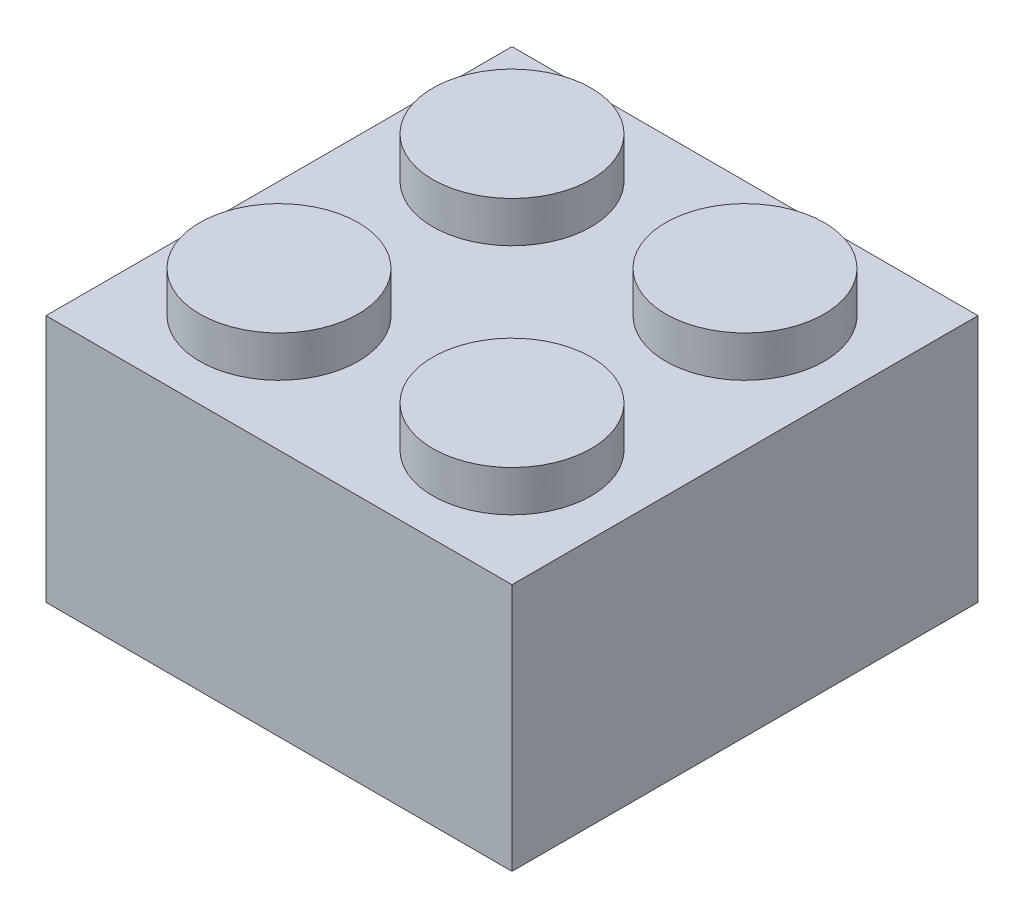
ISO-10303-21;
HEADER;
FILE_DESCRIPTION(('STEP AP214'),'2;1');
FILE_NAME('part.step','',(''),(''),'','','');
FILE_SCHEMA(('AUTOMOTIVE_DESIGN { 1 0 10303 214 1 1 1 1 }'));
ENDSEC;
DATA;
#1=APPLICATION_CONTEXT('core data for automotive mechanical design processes');
#2=APPLICATION_PROTOCOL_DEFINITION('international standard','automotive_design',2000,#1);
#3=PRODUCT_CONTEXT('',#1,'mechanical');
#4=PRODUCT('Part','Part','',(#3));
#5=PRODUCT_RELATED_PRODUCT_CATEGORY('part','',(#4));
#6=PRODUCT_DEFINITION_FORMATION('','',#4);
#7=PRODUCT_DEFINITION_CONTEXT('part definition',#1,'design');
#8=PRODUCT_DEFINITION('design','',#6,#7);
#9=PRODUCT_DEFINITION_SHAPE('','',#8);
#10=(LENGTH_UNIT() NAMED_UNIT(*) SI_UNIT(.MILLI.,.METRE.));
#11=(NAMED_UNIT(*) PLANE_ANGLE_UNIT() SI_UNIT($,.RADIAN.));
#12=(NAMED_UNIT(*) SI_UNIT($,.STERADIAN.) SOLID_ANGLE_UNIT());
#13=UNCERTAINTY_MEASURE_WITH_UNIT(LENGTH_MEASURE(1.E-05),#10,'distance_accuracy_value','');
#14=(GEOMETRIC_REPRESENTATION_CONTEXT(3) GLOBAL_UNCERTAINTY_ASSIGNED_CONTEXT((#13)) GLOBAL_UNIT_ASSIGNED_CONTEXT((#10,
#11,#12)) REPRESENTATION_CONTEXT('',''));
#15=CARTESIAN_POINT('',(0.,0.,0.));
#16=DIRECTION('',(0.,0.,1.));
#17=DIRECTION('',(1.,0.,0.));
#18=AXIS2_PLACEMENT_3D('',#15,#16,#17);
#19=CARTESIAN_POINT('',(-7.9375,4.2291,7.9375));
#20=DIRECTION('',(0.,-1.,0.));
#21=DIRECTION('',(0.,0.,-1.));
#22=AXIS2_PLACEMENT_3D('',#19,#20,#21);
#23=PLANE('',#22);
#24=CARTESIAN_POINT('',(3.96875,4.2291,3.96875));
#25=DIRECTION('',(0.,-1.,0.));
#26=DIRECTION('',(0.,0.,-1.));
#27=AXIS2_PLACEMENT_3D('',#24,#25,#26);
#28=CIRCLE('',#27,2.69875);
#29=CARTESIAN_POINT('',(3.96875,4.2291,1.27));
#30=VERTEX_POINT('',#29);
#31=EDGE_CURVE('E182',#30,#30,#28,.F.);
#32=ORIENTED_EDGE('',*,*,#31,.F.);
#33=EDGE_LOOP('',(#32));
#34=FACE_BOUND('',#33,.T.);
#35=DIRECTION('',(0.,0.,1.));
#36=VECTOR('',#35,1.);
#37=CARTESIAN_POINT('',(-7.9375,4.2291,-7.9375));
#38=LINE('',#37,#36);
#39=CARTESIAN_POINT('',(-7.9375,4.2291,-7.9375));
#40=VERTEX_POINT('',#39);
#41=CARTESIAN_POINT('',(-7.9375,4.2291,7.9375));
#42=VERTEX_POINT('',#41);
#43=EDGE_CURVE('E159',#40,#42,#38,.T.);
#44=ORIENTED_EDGE('',*,*,#43,.T.);
#45=DIRECTION('',(1.,0.,0.));
#46=VECTOR('',#45,1.);
#47=CARTESIAN_POINT('',(7.9375,4.2291,7.9375));
#48=LINE('',#47,#46);
#49=CARTESIAN_POINT('',(7.9375,4.2291,7.9375));
#50=VERTEX_POINT('',#49);
#51=EDGE_CURVE('E103',#42,#50,#48,.T.);
#52=ORIENTED_EDGE('',*,*,#51,.T.);
#53=DIRECTION('',(0.,0.,-1.));
#54=VECTOR('',#53,1.);
#55=CARTESIAN_POINT('',(7.9375,4.2291,-7.9375));
#56=LINE('',#55,#54);
#57=CARTESIAN_POINT('',(7.9375,4.2291,-7.9375));
#58=VERTEX_POINT('',#57);
#59=EDGE_CURVE('E162',#50,#58,#56,.T.);
#60=ORIENTED_EDGE('',*,*,#59,.T.);
#61=DIRECTION('',(-1.,0.,0.));
#62=VECTOR('',#61,1.);
#63=CARTESIAN_POINT('',(7.9375,4.2291,-7.9375));
#64=LINE('',#63,#62);
#65=EDGE_CURVE('E74',#58,#40,#64,.T.);
#66=ORIENTED_EDGE('',*,*,#65,.T.);
#67=EDGE_LOOP('',(#44,#52,#60,#66));
#68=FACE_BOUND('',#67,.T.);
#69=CARTESIAN_POINT('',(-3.96875,4.2291,3.96875));
#70=DIRECTION('',(0.,-1.,0.));
#71=DIRECTION('',(0.,0.,-1.));
#72=AXIS2_PLACEMENT_3D('',#69,#70,#71);
#73=CIRCLE('',#72,2.69875);
#74=CARTESIAN_POINT('',(-3.96875,4.2291,1.27));
#75=VERTEX_POINT('',#74);
#76=EDGE_CURVE('E185',#75,#75,#73,.F.);
#77=ORIENTED_EDGE('',*,*,#76,.F.);
#78=EDGE_LOOP('',(#77));
#79=FACE_BOUND('',#78,.T.);
#80=CARTESIAN_POINT('',(3.96875,4.2291,-3.96875));
#81=DIRECTION('',(0.,-1.,0.));
#82=DIRECTION('',(0.,0.,-1.));
#83=AXIS2_PLACEMENT_3D('',#80,#81,#82);
#84=CIRCLE('',#83,2.69875);
#85=CARTESIAN_POINT('',(3.96875,4.2291,-6.6675));
#86=VERTEX_POINT('',#85);
#87=EDGE_CURVE('E188',#86,#86,#84,.F.);
#88=ORIENTED_EDGE('',*,*,#87,.F.);
#89=EDGE_LOOP('',(#88));
#90=FACE_BOUND('',#89,.T.);
#91=CARTESIAN_POINT('',(-3.96875,4.2291,-3.96875));
#92=DIRECTION('',(0.,-1.,0.));
#93=DIRECTION('',(0.,0.,-1.));
#94=AXIS2_PLACEMENT_3D('',#91,#92,#93);
#95=CIRCLE('',#94,2.69875);
#96=CARTESIAN_POINT('',(-3.96875,4.2291,-6.6675));
#97=VERTEX_POINT('',#96);
#98=EDGE_CURVE('E58',#97,#97,#95,.F.);
#99=ORIENTED_EDGE('',*,*,#98,.F.);
#100=EDGE_LOOP('',(#99));
#101=FACE_BOUND('',#100,.T.);
#102=ADVANCED_FACE('F50',(#34,#68,#79,#90,#101),#23,.F.);
#103=CARTESIAN_POINT('',(-7.9375,4.2291,-7.9375));
#104=DIRECTION('',(1.,0.,0.));
#105=DIRECTION('',(0.,0.,-1.));
#106=AXIS2_PLACEMENT_3D('',#103,#104,#105);
#107=PLANE('',#106);
#108=DIRECTION('',(0.,0.,1.));
#109=VECTOR('',#108,1.);
#110=CARTESIAN_POINT('',(-7.9375,-4.2291,-7.9375));
#111=LINE('',#110,#109);
#112=CARTESIAN_POINT('',(-7.9375,-4.2291,-7.9375));
#113=VERTEX_POINT('',#112);
#114=CARTESIAN_POINT('',(-7.9375,-4.2291,7.9375));
#115=VERTEX_POINT('',#114);
#116=EDGE_CURVE('E166',#113,#115,#111,.T.);
#117=ORIENTED_EDGE('',*,*,#116,.T.);
#118=DIRECTION('',(0.,-1.,0.));
#119=VECTOR('',#118,1.);
#120=CARTESIAN_POINT('',(-7.9375,4.2291,7.9375));
#121=LINE('',#120,#119);
#122=EDGE_CURVE('E180',#42,#115,#121,.T.);
#123=ORIENTED_EDGE('',*,*,#122,.F.);
#124=ORIENTED_EDGE('',*,*,#43,.F.);
#125=DIRECTION('',(0.,-1.,0.));
#126=VECTOR('',#125,1.);
#127=CARTESIAN_POINT('',(-7.9375,4.2291,-7.9375));
#128=LINE('',#127,#126);
#129=EDGE_CURVE('E165',#40,#113,#128,.T.);
#130=ORIENTED_EDGE('',*,*,#129,.T.);
#131=EDGE_LOOP('',(#117,#123,#124,#130));
#132=FACE_BOUND('',#131,.T.);
#133=ADVANCED_FACE('F199',(#132),#107,.F.);
#134=CARTESIAN_POINT('',(7.9375,4.2291,7.9375));
#135=DIRECTION('',(0.,0.,-1.));
#136=DIRECTION('',(-1.,0.,0.));
#137=AXIS2_PLACEMENT_3D('',#134,#135,#136);
#138=PLANE('',#137);
#139=DIRECTION('',(1.,0.,0.));
#140=VECTOR('',#139,1.);
#141=CARTESIAN_POINT('',(7.9375,-4.2291,7.9375));
#142=LINE('',#141,#140);
#143=CARTESIAN_POINT('',(7.9375,-4.2291,7.9375));
#144=VERTEX_POINT('',#143);
#145=EDGE_CURVE('E169',#115,#144,#142,.T.);
#146=ORIENTED_EDGE('',*,*,#145,.T.);
#147=DIRECTION('',(0.,-1.,0.));
#148=VECTOR('',#147,1.);
#149=CARTESIAN_POINT('',(7.9375,4.2291,7.9375));
#150=LINE('',#149,#148);
#151=EDGE_CURVE('E177',#50,#144,#150,.T.);
#152=ORIENTED_EDGE('',*,*,#151,.F.);
#153=ORIENTED_EDGE('',*,*,#51,.F.);
#154=ORIENTED_EDGE('',*,*,#122,.T.);
#155=EDGE_LOOP('',(#146,#152,#153,#154));
#156=FACE_BOUND('',#155,.T.);
#157=ADVANCED_FACE('F205',(#156),#138,.F.);
#158=CARTESIAN_POINT('',(7.9375,4.2291,-7.9375));
#159=DIRECTION('',(-1.,0.,0.));
#160=DIRECTION('',(0.,0.,1.));
#161=AXIS2_PLACEMENT_3D('',#158,#159,#160);
#162=PLANE('',#161);
#163=DIRECTION('',(0.,0.,-1.));
#164=VECTOR('',#163,1.);
#165=CARTESIAN_POINT('',(7.9375,-4.2291,-7.9375));
#166=LINE('',#165,#164);
#167=CARTESIAN_POINT('',(7.9375,-4.2291,-7.9375));
#168=VERTEX_POINT('',#167);
#169=EDGE_CURVE('E171',#144,#168,#166,.T.);
#170=ORIENTED_EDGE('',*,*,#169,.T.);
#171=DIRECTION('',(0.,-1.,0.));
#172=VECTOR('',#171,1.);
#173=CARTESIAN_POINT('',(7.9375,4.2291,-7.9375));
#174=LINE('',#173,#172);
#175=EDGE_CURVE('E175',#58,#168,#174,.T.);
#176=ORIENTED_EDGE('',*,*,#175,.F.);
#177=ORIENTED_EDGE('',*,*,#59,.F.);
#178=ORIENTED_EDGE('',*,*,#151,.T.);
#179=EDGE_LOOP('',(#170,#176,#177,#178));
#180=FACE_BOUND('',#179,.T.);
#181=ADVANCED_FACE('F220',(#180),#162,.F.);
#182=CARTESIAN_POINT('',(7.9375,4.2291,-7.9375));
#183=DIRECTION('',(0.,0.,1.));
#184=DIRECTION('',(1.,0.,0.));
#185=AXIS2_PLACEMENT_3D('',#182,#183,#184);
#186=PLANE('',#185);
#187=DIRECTION('',(-1.,0.,0.));
#188=VECTOR('',#187,1.);
#189=CARTESIAN_POINT('',(7.9375,-4.2291,-7.9375));
#190=LINE('',#189,#188);
#191=EDGE_CURVE('E95',#168,#113,#190,.T.);
#192=ORIENTED_EDGE('',*,*,#191,.T.);
#193=ORIENTED_EDGE('',*,*,#129,.F.);
#194=ORIENTED_EDGE('',*,*,#65,.F.);
#195=ORIENTED_EDGE('',*,*,#175,.T.);
#196=EDGE_LOOP('',(#192,#193,#194,#195));
#197=FACE_BOUND('',#196,.T.);
#198=ADVANCED_FACE('F215',(#197),#186,.F.);
#199=CARTESIAN_POINT('',(-7.9375,-4.2291,7.9375));
#200=DIRECTION('',(0.,-1.,0.));
#201=DIRECTION('',(0.,0.,-1.));
#202=AXIS2_PLACEMENT_3D('',#199,#200,#201);
#203=PLANE('',#202);
#204=DIRECTION('',(0.,0.,1.));
#205=VECTOR('',#204,1.);
#206=CARTESIAN_POINT('',(6.6675,-4.2291,-17.6039213562373));
#207=LINE('',#206,#205);
#208=CARTESIAN_POINT('',(6.6675,-4.2291,-6.6675));
#209=VERTEX_POINT('',#208);
#210=CARTESIAN_POINT('',(6.6675,-4.2291,6.6675));
#211=VERTEX_POINT('',#210);
#212=EDGE_CURVE('E65',#209,#211,#207,.T.);
#213=ORIENTED_EDGE('',*,*,#212,.F.);
#214=DIRECTION('',(1.,0.,0.));
#215=VECTOR('',#214,1.);
#216=CARTESIAN_POINT('',(0.,-4.2291,-6.6675));
#217=LINE('',#216,#215);
#218=CARTESIAN_POINT('',(-6.6675,-4.2291,-6.6675));
#219=VERTEX_POINT('',#218);
#220=EDGE_CURVE('E134',#219,#209,#217,.T.);
#221=ORIENTED_EDGE('',*,*,#220,.F.);
#222=DIRECTION('',(0.,0.,-1.));
#223=VECTOR('',#222,1.);
#224=CARTESIAN_POINT('',(-6.6675,-4.2291,-17.6039213562373));
#225=LINE('',#224,#223);
#226=CARTESIAN_POINT('',(-6.6675,-4.2291,6.6675));
#227=VERTEX_POINT('',#226);
#228=EDGE_CURVE('E422',#227,#219,#225,.T.);
#229=ORIENTED_EDGE('',*,*,#228,.F.);
#230=DIRECTION('',(-1.,0.,0.));
#231=VECTOR('',#230,1.);
#232=CARTESIAN_POINT('',(0.,-4.2291,6.6675));
#233=LINE('',#232,#231);
#234=EDGE_CURVE('E420',#211,#227,#233,.T.);
#235=ORIENTED_EDGE('',*,*,#234,.F.);
#236=EDGE_LOOP('',(#213,#221,#229,#235));
#237=FACE_BOUND('',#236,.T.);
#238=ORIENTED_EDGE('',*,*,#116,.F.);
#239=ORIENTED_EDGE('',*,*,#191,.F.);
#240=ORIENTED_EDGE('',*,*,#169,.F.);
#241=ORIENTED_EDGE('',*,*,#145,.F.);
#242=EDGE_LOOP('',(#238,#239,#240,#241));
#243=FACE_BOUND('',#242,.T.);
#244=ADVANCED_FACE('F212',(#237,#243),#203,.T.);
#245=CARTESIAN_POINT('',(6.6675,23.0876378542452,-17.6039213562373));
#246=DIRECTION('',(1.,0.,0.));
#247=DIRECTION('',(0.,0.,-1.));
#248=AXIS2_PLACEMENT_3D('',#245,#246,#247);
#249=PLANE('',#248);
#250=DIRECTION('',(0.,0.,-1.));
#251=VECTOR('',#250,1.);
#252=CARTESIAN_POINT('',(6.6675,2.9591,-17.6039213562373));
#253=LINE('',#252,#251);
#254=CARTESIAN_POINT('',(6.6675,2.9591,6.6675));
#255=VERTEX_POINT('',#254);
#256=CARTESIAN_POINT('',(6.6675,2.9591,-6.6675));
#257=VERTEX_POINT('',#256);
#258=EDGE_CURVE('E124',#255,#257,#253,.T.);
#259=ORIENTED_EDGE('',*,*,#258,.T.);
#260=DIRECTION('',(0.,-1.,0.));
#261=VECTOR('',#260,1.);
#262=CARTESIAN_POINT('',(6.6675,23.0876378542452,-6.6675));
#263=LINE('',#262,#261);
#264=EDGE_CURVE('E128',#257,#209,#263,.T.);
#265=ORIENTED_EDGE('',*,*,#264,.T.);
#266=ORIENTED_EDGE('',*,*,#212,.T.);
#267=DIRECTION('',(0.,-1.,0.));
#268=VECTOR('',#267,1.);
#269=CARTESIAN_POINT('',(6.6675,23.0876378542452,6.66749999999999));
#270=LINE('',#269,#268);
#271=EDGE_CURVE('E130',#255,#211,#270,.T.);
#272=ORIENTED_EDGE('',*,*,#271,.F.);
#273=EDGE_LOOP('',(#259,#265,#266,#272));
#274=FACE_BOUND('',#273,.T.);
#275=ADVANCED_FACE('F126',(#274),#249,.F.);
#276=CARTESIAN_POINT('',(0.,23.0876378542452,-6.6675));
#277=DIRECTION('',(0.,0.,-1.));
#278=DIRECTION('',(-1.,0.,0.));
#279=AXIS2_PLACEMENT_3D('',#276,#277,#278);
#280=PLANE('',#279);
#281=DIRECTION('',(-1.,0.,0.));
#282=VECTOR('',#281,1.);
#283=CARTESIAN_POINT('',(0.,2.9591,-6.6675));
#284=LINE('',#283,#282);
#285=CARTESIAN_POINT('',(-6.6675,2.9591,-6.6675));
#286=VERTEX_POINT('',#285);
#287=EDGE_CURVE('E133',#257,#286,#284,.T.);
#288=ORIENTED_EDGE('',*,*,#287,.T.);
#289=DIRECTION('',(0.,-1.,0.));
#290=VECTOR('',#289,1.);
#291=CARTESIAN_POINT('',(-6.6675,23.0876378542452,-6.6675));
#292=LINE('',#291,#290);
#293=EDGE_CURVE('E145',#286,#219,#292,.T.);
#294=ORIENTED_EDGE('',*,*,#293,.T.);
#295=ORIENTED_EDGE('',*,*,#220,.T.);
#296=ORIENTED_EDGE('',*,*,#264,.F.);
#297=EDGE_LOOP('',(#288,#294,#295,#296));
#298=FACE_BOUND('',#297,.T.);
#299=ADVANCED_FACE('F143',(#298),#280,.F.);
#300=CARTESIAN_POINT('',(-6.6675,23.0876378542452,-17.6039213562373));
#301=DIRECTION('',(-1.,0.,0.));
#302=DIRECTION('',(0.,0.,1.));
#303=AXIS2_PLACEMENT_3D('',#300,#301,#302);
#304=PLANE('',#303);
#305=DIRECTION('',(0.,0.,1.));
#306=VECTOR('',#305,1.);
#307=CARTESIAN_POINT('',(-6.6675,2.9591,-17.6039213562373));
#308=LINE('',#307,#306);
#309=CARTESIAN_POINT('',(-6.6675,2.95910000000001,6.6675));
#310=VERTEX_POINT('',#309);
#311=EDGE_CURVE('E139',#286,#310,#308,.T.);
#312=ORIENTED_EDGE('',*,*,#311,.T.);
#313=DIRECTION('',(0.,-1.,0.));
#314=VECTOR('',#313,1.);
#315=CARTESIAN_POINT('',(-6.6675,23.0876378542452,6.6675));
#316=LINE('',#315,#314);
#317=EDGE_CURVE('E155',#310,#227,#316,.T.);
#318=ORIENTED_EDGE('',*,*,#317,.T.);
#319=ORIENTED_EDGE('',*,*,#228,.T.);
#320=ORIENTED_EDGE('',*,*,#293,.F.);
#321=EDGE_LOOP('',(#312,#318,#319,#320));
#322=FACE_BOUND('',#321,.T.);
#323=ADVANCED_FACE('F324',(#322),#304,.F.);
#324=CARTESIAN_POINT('',(0.,23.0876378542452,0.));
#325=DIRECTION('',(0.,-1.,0.));
#326=DIRECTION('',(0.,0.,-1.));
#327=AXIS2_PLACEMENT_3D('',#324,#325,#326);
#328=CYLINDRICAL_SURFACE('',#327,3.175);
#329=CARTESIAN_POINT('',(0.,2.9591,0.));
#330=DIRECTION('',(0.,-1.,0.));
#331=DIRECTION('',(0.,0.,-1.));
#332=AXIS2_PLACEMENT_3D('',#329,#330,#331);
#333=CIRCLE('',#332,3.175);
#334=CARTESIAN_POINT('',(0.,2.9591,-3.175));
#335=VERTEX_POINT('',#334);
#336=EDGE_CURVE('E147',#335,#335,#333,.F.);
#337=ORIENTED_EDGE('',*,*,#336,.F.);
#338=EDGE_LOOP('',(#337));
#339=FACE_BOUND('',#338,.T.);
#340=CARTESIAN_POINT('',(0.,-4.2291,0.));
#341=DIRECTION('',(0.,-1.,0.));
#342=DIRECTION('',(0.,0.,-1.));
#343=AXIS2_PLACEMENT_3D('',#340,#341,#342);
#344=CIRCLE('',#343,3.175);
#345=CARTESIAN_POINT('',(0.,-4.2291,-3.175));
#346=VERTEX_POINT('',#345);
#347=EDGE_CURVE('E156',#346,#346,#344,.T.);
#348=ORIENTED_EDGE('',*,*,#347,.F.);
#349=EDGE_LOOP('',(#348));
#350=FACE_BOUND('',#349,.T.);
#351=ADVANCED_FACE('F316',(#339,#350),#328,.T.);
#352=CARTESIAN_POINT('',(0.,23.0876378542452,6.6675));
#353=DIRECTION('',(0.,0.,1.));
#354=DIRECTION('',(1.,0.,0.));
#355=AXIS2_PLACEMENT_3D('',#352,#353,#354);
#356=PLANE('',#355);
#357=DIRECTION('',(1.,0.,0.));
#358=VECTOR('',#357,1.);
#359=CARTESIAN_POINT('',(0.,2.9591,6.6675));
#360=LINE('',#359,#358);
#361=EDGE_CURVE('E152',#310,#255,#360,.T.);
#362=ORIENTED_EDGE('',*,*,#361,.T.);
#363=ORIENTED_EDGE('',*,*,#271,.T.);
#364=ORIENTED_EDGE('',*,*,#234,.T.);
#365=ORIENTED_EDGE('',*,*,#317,.F.);
#366=EDGE_LOOP('',(#362,#363,#364,#365));
#367=FACE_BOUND('',#366,.T.);
#368=ADVANCED_FACE('F310',(#367),#356,.F.);
#369=CARTESIAN_POINT('',(-7.9375,2.9591,7.9375));
#370=DIRECTION('',(0.,-1.,0.));
#371=DIRECTION('',(0.,0.,-1.));
#372=AXIS2_PLACEMENT_3D('',#369,#370,#371);
#373=PLANE('',#372);
#374=ORIENTED_EDGE('',*,*,#258,.F.);
#375=ORIENTED_EDGE('',*,*,#361,.F.);
#376=ORIENTED_EDGE('',*,*,#311,.F.);
#377=ORIENTED_EDGE('',*,*,#287,.F.);
#378=EDGE_LOOP('',(#374,#375,#376,#377));
#379=FACE_BOUND('',#378,.T.);
#380=ORIENTED_EDGE('',*,*,#336,.T.);
#381=EDGE_LOOP('',(#380));
#382=FACE_BOUND('',#381,.T.);
#383=ADVANCED_FACE('F137',(#379,#382),#373,.T.);
#384=CARTESIAN_POINT('',(0.,-4.2291,0.));
#385=DIRECTION('',(0.,-1.,0.));
#386=DIRECTION('',(0.,0.,-1.));
#387=AXIS2_PLACEMENT_3D('',#384,#385,#386);
#388=CIRCLE('',#387,2.413);
#389=CARTESIAN_POINT('',(0.,-4.2291,-2.413));
#390=VERTEX_POINT('',#389);
#391=EDGE_CURVE('E438',#390,#390,#388,.T.);
#392=ORIENTED_EDGE('',*,*,#391,.F.);
#393=EDGE_LOOP('',(#392));
#394=FACE_BOUND('',#393,.T.);
#395=ORIENTED_EDGE('',*,*,#347,.T.);
#396=EDGE_LOOP('',(#395));
#397=FACE_BOUND('',#396,.T.);
#398=ADVANCED_FACE('F217',(#394,#397),#203,.T.);
#399=CARTESIAN_POINT('',(0.,23.0876378542452,0.));
#400=DIRECTION('',(0.,-1.,0.));
#401=DIRECTION('',(0.,0.,-1.));
#402=AXIS2_PLACEMENT_3D('',#399,#400,#401);
#403=CYLINDRICAL_SURFACE('',#402,2.413);
#404=CARTESIAN_POINT('',(0.,2.9591,0.));
#405=DIRECTION('',(0.,-1.,0.));
#406=DIRECTION('',(0.,0.,-1.));
#407=AXIS2_PLACEMENT_3D('',#404,#405,#406);
#408=CIRCLE('',#407,2.413);
#409=CARTESIAN_POINT('',(0.,2.9591,-2.413));
#410=VERTEX_POINT('',#409);
#411=EDGE_CURVE('E149',#410,#410,#408,.F.);
#412=ORIENTED_EDGE('',*,*,#411,.T.);
#413=EDGE_LOOP('',(#412));
#414=FACE_BOUND('',#413,.T.);
#415=ORIENTED_EDGE('',*,*,#391,.T.);
#416=EDGE_LOOP('',(#415));
#417=FACE_BOUND('',#416,.T.);
#418=ADVANCED_FACE('F289',(#414,#417),#403,.F.);
#419=CARTESIAN_POINT('',(-7.9375,2.9591,7.9375));
#420=DIRECTION('',(0.,-1.,0.));
#421=DIRECTION('',(0.,0.,-1.));
#422=AXIS2_PLACEMENT_3D('',#419,#420,#421);
#423=PLANE('',#422);
#424=ORIENTED_EDGE('',*,*,#411,.F.);
#425=EDGE_LOOP('',(#424));
#426=FACE_BOUND('',#425,.T.);
#427=ADVANCED_FACE('F281',(#426),#423,.T.);
#428=CARTESIAN_POINT('',(3.96875,5.6261,3.96875));
#429=DIRECTION('',(0.,-1.,0.));
#430=DIRECTION('',(0.,0.,-1.));
#431=AXIS2_PLACEMENT_3D('',#428,#429,#430);
#432=CYLINDRICAL_SURFACE('',#431,2.69875);
#433=CARTESIAN_POINT('',(3.96875,5.6261,3.96875));
#434=DIRECTION('',(0.,1.,0.));
#435=DIRECTION('',(0.,0.,1.));
#436=AXIS2_PLACEMENT_3D('',#433,#434,#435);
#437=CIRCLE('',#436,2.69875);
#438=CARTESIAN_POINT('',(3.96875,5.6261,6.6675));
#439=VERTEX_POINT('',#438);
#440=EDGE_CURVE('E441',#439,#439,#437,.T.);
#441=ORIENTED_EDGE('',*,*,#440,.F.);
#442=EDGE_LOOP('',(#441));
#443=FACE_BOUND('',#442,.T.);
#444=ORIENTED_EDGE('',*,*,#31,.T.);
#445=EDGE_LOOP('',(#444));
#446=FACE_BOUND('',#445,.T.);
#447=ADVANCED_FACE('F273',(#443,#446),#432,.T.);
#448=CARTESIAN_POINT('',(3.96875,5.6261,3.96875));
#449=DIRECTION('',(0.,1.,0.));
#450=DIRECTION('',(0.,0.,1.));
#451=AXIS2_PLACEMENT_3D('',#448,#449,#450);
#452=PLANE('',#451);
#453=ORIENTED_EDGE('',*,*,#440,.T.);
#454=EDGE_LOOP('',(#453));
#455=FACE_BOUND('',#454,.T.);
#456=ADVANCED_FACE('F265',(#455),#452,.T.);
#457=CARTESIAN_POINT('',(-3.96875,5.6261,3.96875));
#458=DIRECTION('',(0.,-1.,0.));
#459=DIRECTION('',(0.,0.,-1.));
#460=AXIS2_PLACEMENT_3D('',#457,#458,#459);
#461=CYLINDRICAL_SURFACE('',#460,2.69875);
#462=CARTESIAN_POINT('',(-3.96875,5.6261,3.96875));
#463=DIRECTION('',(0.,1.,0.));
#464=DIRECTION('',(0.,0.,1.));
#465=AXIS2_PLACEMENT_3D('',#462,#463,#464);
#466=CIRCLE('',#465,2.69875);
#467=CARTESIAN_POINT('',(-3.96875,5.6261,6.6675));
#468=VERTEX_POINT('',#467);
#469=EDGE_CURVE('E444',#468,#468,#466,.T.);
#470=ORIENTED_EDGE('',*,*,#469,.F.);
#471=EDGE_LOOP('',(#470));
#472=FACE_BOUND('',#471,.T.);
#473=ORIENTED_EDGE('',*,*,#76,.T.);
#474=EDGE_LOOP('',(#473));
#475=FACE_BOUND('',#474,.T.);
#476=ADVANCED_FACE('F257',(#472,#475),#461,.T.);
#477=CARTESIAN_POINT('',(-3.96875,5.6261,3.96875));
#478=DIRECTION('',(0.,1.,0.));
#479=DIRECTION('',(0.,0.,1.));
#480=AXIS2_PLACEMENT_3D('',#477,#478,#479);
#481=PLANE('',#480);
#482=ORIENTED_EDGE('',*,*,#469,.T.);
#483=EDGE_LOOP('',(#482));
#484=FACE_BOUND('',#483,.T.);
#485=ADVANCED_FACE('F232',(#484),#481,.T.);
#486=CARTESIAN_POINT('',(3.96875,5.6261,-3.96875));
#487=DIRECTION('',(0.,1.,0.));
#488=DIRECTION('',(0.,0.,1.));
#489=AXIS2_PLACEMENT_3D('',#486,#487,#488);
#490=PLANE('',#489);
#491=CARTESIAN_POINT('',(3.96875,5.6261,-3.96875));
#492=DIRECTION('',(0.,1.,0.));
#493=DIRECTION('',(0.,0.,1.));
#494=AXIS2_PLACEMENT_3D('',#491,#492,#493);
#495=CIRCLE('',#494,2.69875);
#496=CARTESIAN_POINT('',(3.96875,5.6261,-1.27));
#497=VERTEX_POINT('',#496);
#498=EDGE_CURVE('E191',#497,#497,#495,.T.);
#499=ORIENTED_EDGE('',*,*,#498,.T.);
#500=EDGE_LOOP('',(#499));
#501=FACE_BOUND('',#500,.T.);
#502=ADVANCED_FACE('F229',(#501),#490,.T.);
#503=CARTESIAN_POINT('',(3.96875,5.6261,-3.96875));
#504=DIRECTION('',(0.,-1.,0.));
#505=DIRECTION('',(0.,0.,-1.));
#506=AXIS2_PLACEMENT_3D('',#503,#504,#505);
#507=CYLINDRICAL_SURFACE('',#506,2.69875);
#508=ORIENTED_EDGE('',*,*,#498,.F.);
#509=EDGE_LOOP('',(#508));
#510=FACE_BOUND('',#509,.T.);
#511=ORIENTED_EDGE('',*,*,#87,.T.);
#512=EDGE_LOOP('',(#511));
#513=FACE_BOUND('',#512,.T.);
#514=ADVANCED_FACE('F226',(#510,#513),#507,.T.);
#515=CARTESIAN_POINT('',(-3.96875,5.6261,-3.96875));
#516=DIRECTION('',(0.,1.,0.));
#517=DIRECTION('',(0.,0.,1.));
#518=AXIS2_PLACEMENT_3D('',#515,#516,#517);
#519=PLANE('',#518);
#520=CARTESIAN_POINT('',(-3.96875,5.6261,-3.96875));
#521=DIRECTION('',(0.,1.,0.));
#522=DIRECTION('',(0.,0.,1.));
#523=AXIS2_PLACEMENT_3D('',#520,#521,#522);
#524=CIRCLE('',#523,2.69875);
#525=CARTESIAN_POINT('',(-3.96875,5.6261,-1.27));
#526=VERTEX_POINT('',#525);
#527=EDGE_CURVE('E13',#526,#526,#524,.T.);
#528=ORIENTED_EDGE('',*,*,#527,.T.);
#529=EDGE_LOOP('',(#528));
#530=FACE_BOUND('',#529,.T.);
#531=ADVANCED_FACE('F52',(#530),#519,.T.);
#532=CARTESIAN_POINT('',(-3.96875,5.6261,-3.96875));
#533=DIRECTION('',(0.,-1.,0.));
#534=DIRECTION('',(0.,0.,-1.));
#535=AXIS2_PLACEMENT_3D('',#532,#533,#534);
#536=CYLINDRICAL_SURFACE('',#535,2.69875);
#537=ORIENTED_EDGE('',*,*,#527,.F.);
#538=EDGE_LOOP('',(#537));
#539=FACE_BOUND('',#538,.T.);
#540=ORIENTED_EDGE('',*,*,#98,.T.);
#541=EDGE_LOOP('',(#540));
#542=FACE_BOUND('',#541,.T.);
#543=ADVANCED_FACE('F196',(#539,#542),#536,.T.);
#544=CLOSED_SHELL('',(#102,#133,#157,#181,#198,#244,#275,#299,#323,#351,#368,#383,#398,#418,
#427,#447,#456,#476,#485,#502,#514,#531,#543));
#545=MANIFOLD_SOLID_BREP('B2',#544);
#546=ADVANCED_BREP_SHAPE_REPRESENTATION('',(#18,#545),#14);
#547=SHAPE_DEFINITION_REPRESENTATION(#9,#546);
ENDSEC;
END-ISO-10303-21;
